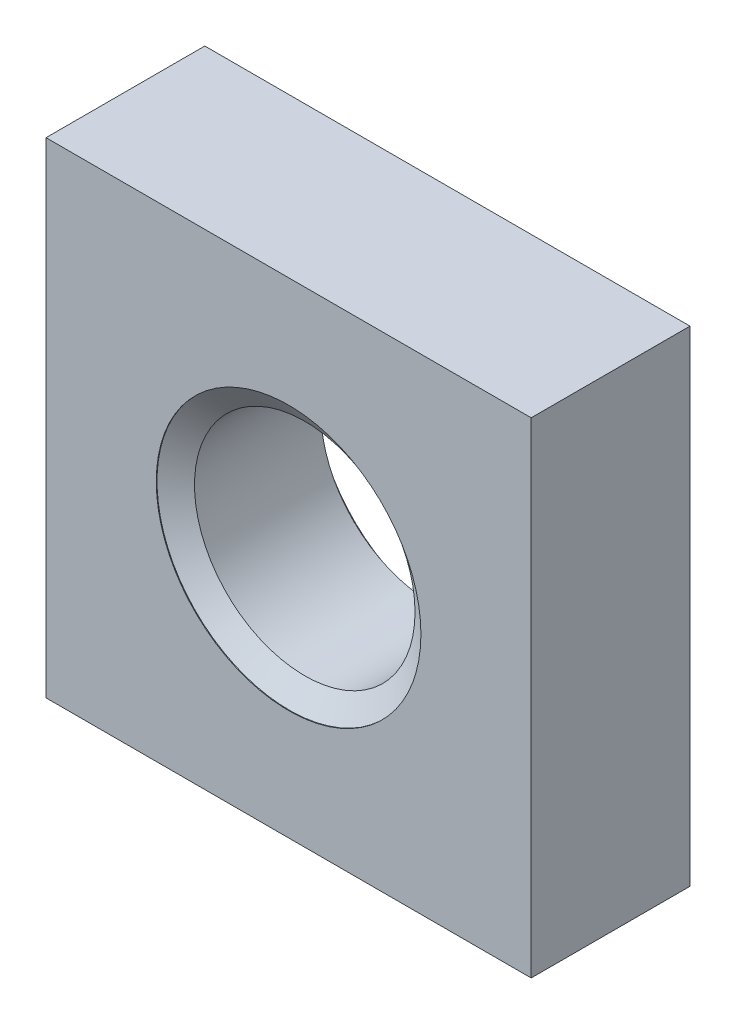
ISO-10303-21;
HEADER;
FILE_DESCRIPTION(('STEP AP214'),'2;1');
FILE_NAME('part.step','',(''),(''),'','','');
FILE_SCHEMA(('AUTOMOTIVE_DESIGN { 1 0 10303 214 1 1 1 1 }'));
ENDSEC;
DATA;
#1=APPLICATION_CONTEXT('core data for automotive mechanical design processes');
#2=APPLICATION_PROTOCOL_DEFINITION('international standard','automotive_design',2000,#1);
#3=PRODUCT_CONTEXT('',#1,'mechanical');
#4=PRODUCT('Part','Part','',(#3));
#5=PRODUCT_RELATED_PRODUCT_CATEGORY('part','',(#4));
#6=PRODUCT_DEFINITION_FORMATION('','',#4);
#7=PRODUCT_DEFINITION_CONTEXT('part definition',#1,'design');
#8=PRODUCT_DEFINITION('design','',#6,#7);
#9=PRODUCT_DEFINITION_SHAPE('','',#8);
#10=(LENGTH_UNIT() NAMED_UNIT(*) SI_UNIT(.MILLI.,.METRE.));
#11=(NAMED_UNIT(*) PLANE_ANGLE_UNIT() SI_UNIT($,.RADIAN.));
#12=(NAMED_UNIT(*) SI_UNIT($,.STERADIAN.) SOLID_ANGLE_UNIT());
#13=UNCERTAINTY_MEASURE_WITH_UNIT(LENGTH_MEASURE(1.E-05),#10,'distance_accuracy_value','');
#14=(GEOMETRIC_REPRESENTATION_CONTEXT(3) GLOBAL_UNCERTAINTY_ASSIGNED_CONTEXT((#13)) GLOBAL_UNIT_ASSIGNED_CONTEXT((#10,
#11,#12)) REPRESENTATION_CONTEXT('',''));
#15=CARTESIAN_POINT('',(0.,0.,0.));
#16=DIRECTION('',(0.,0.,1.));
#17=DIRECTION('',(1.,0.,0.));
#18=AXIS2_PLACEMENT_3D('',#15,#16,#17);
#19=CARTESIAN_POINT('',(0.,0.,-1.8));
#20=DIRECTION('',(0.,0.,1.));
#21=DIRECTION('',(1.,0.,0.));
#22=AXIS2_PLACEMENT_3D('',#19,#20,#21);
#23=CYLINDRICAL_SURFACE('',#22,1.25);
#24=CARTESIAN_POINT('',(0.,0.,-0.183051884552427));
#25=DIRECTION('',(0.,0.,1.));
#26=DIRECTION('',(1.,0.,0.));
#27=AXIS2_PLACEMENT_3D('',#24,#25,#26);
#28=CIRCLE('',#27,1.25);
#29=CARTESIAN_POINT('',(1.25,0.,-0.183051884552427));
#30=VERTEX_POINT('',#29);
#31=EDGE_CURVE('E114',#30,#30,#28,.F.);
#32=ORIENTED_EDGE('',*,*,#31,.F.);
#33=EDGE_LOOP('',(#32));
#34=FACE_BOUND('',#33,.T.);
#35=CARTESIAN_POINT('',(0.,0.,-1.61594811544757));
#36=DIRECTION('',(0.,0.,-1.));
#37=DIRECTION('',(-1.,0.,0.));
#38=AXIS2_PLACEMENT_3D('',#35,#36,#37);
#39=CIRCLE('',#38,1.25);
#40=CARTESIAN_POINT('',(-1.25,0.,-1.61594811544757));
#41=VERTEX_POINT('',#40);
#42=EDGE_CURVE('E39',#41,#41,#39,.F.);
#43=ORIENTED_EDGE('',*,*,#42,.F.);
#44=EDGE_LOOP('',(#43));
#45=FACE_BOUND('',#44,.T.);
#46=ADVANCED_FACE('F35',(#34,#45),#23,.F.);
#47=CARTESIAN_POINT('',(-2.75,-2.75,-1.8));
#48=DIRECTION('',(-1.,0.,0.));
#49=DIRECTION('',(0.,0.,1.));
#50=AXIS2_PLACEMENT_3D('',#47,#48,#49);
#51=PLANE('',#50);
#52=DIRECTION('',(0.,-1.,0.));
#53=VECTOR('',#52,1.);
#54=CARTESIAN_POINT('',(-2.75,-2.75,0.));
#55=LINE('',#54,#53);
#56=CARTESIAN_POINT('',(-2.75,2.75,0.));
#57=VERTEX_POINT('',#56);
#58=CARTESIAN_POINT('',(-2.75,-2.75,0.));
#59=VERTEX_POINT('',#58);
#60=EDGE_CURVE('E103',#57,#59,#55,.T.);
#61=ORIENTED_EDGE('',*,*,#60,.F.);
#62=DIRECTION('',(0.,0.,1.));
#63=VECTOR('',#62,1.);
#64=CARTESIAN_POINT('',(-2.75,2.75,-1.8));
#65=LINE('',#64,#63);
#66=CARTESIAN_POINT('',(-2.75,2.75,-1.8));
#67=VERTEX_POINT('',#66);
#68=EDGE_CURVE('E11',#67,#57,#65,.T.);
#69=ORIENTED_EDGE('',*,*,#68,.F.);
#70=DIRECTION('',(0.,-1.,0.));
#71=VECTOR('',#70,1.);
#72=CARTESIAN_POINT('',(-2.75,-2.75,-1.8));
#73=LINE('',#72,#71);
#74=CARTESIAN_POINT('',(-2.75,-2.75,-1.8));
#75=VERTEX_POINT('',#74);
#76=EDGE_CURVE('E96',#67,#75,#73,.T.);
#77=ORIENTED_EDGE('',*,*,#76,.T.);
#78=DIRECTION('',(0.,0.,1.));
#79=VECTOR('',#78,1.);
#80=CARTESIAN_POINT('',(-2.75,-2.75,-1.8));
#81=LINE('',#80,#79);
#82=EDGE_CURVE('E79',#75,#59,#81,.T.);
#83=ORIENTED_EDGE('',*,*,#82,.T.);
#84=EDGE_LOOP('',(#61,#69,#77,#83));
#85=FACE_BOUND('',#84,.T.);
#86=ADVANCED_FACE('F37',(#85),#51,.T.);
#87=CARTESIAN_POINT('',(-2.75,2.75,-1.8));
#88=DIRECTION('',(0.,1.,0.));
#89=DIRECTION('',(-1.,0.,0.));
#90=AXIS2_PLACEMENT_3D('',#87,#88,#89);
#91=PLANE('',#90);
#92=DIRECTION('',(-1.,0.,0.));
#93=VECTOR('',#92,1.);
#94=CARTESIAN_POINT('',(-2.75,2.75,0.));
#95=LINE('',#94,#93);
#96=CARTESIAN_POINT('',(2.75,2.75,0.));
#97=VERTEX_POINT('',#96);
#98=EDGE_CURVE('E98',#97,#57,#95,.T.);
#99=ORIENTED_EDGE('',*,*,#98,.F.);
#100=DIRECTION('',(0.,0.,1.));
#101=VECTOR('',#100,1.);
#102=CARTESIAN_POINT('',(2.75,2.75,-1.8));
#103=LINE('',#102,#101);
#104=CARTESIAN_POINT('',(2.75,2.75,-1.8));
#105=VERTEX_POINT('',#104);
#106=EDGE_CURVE('E45',#105,#97,#103,.T.);
#107=ORIENTED_EDGE('',*,*,#106,.F.);
#108=DIRECTION('',(-1.,0.,0.));
#109=VECTOR('',#108,1.);
#110=CARTESIAN_POINT('',(-2.75,2.75,-1.8));
#111=LINE('',#110,#109);
#112=EDGE_CURVE('E93',#105,#67,#111,.T.);
#113=ORIENTED_EDGE('',*,*,#112,.T.);
#114=ORIENTED_EDGE('',*,*,#68,.T.);
#115=EDGE_LOOP('',(#99,#107,#113,#114));
#116=FACE_BOUND('',#115,.T.);
#117=ADVANCED_FACE('F145',(#116),#91,.T.);
#118=CARTESIAN_POINT('',(2.75,-2.75,-1.8));
#119=DIRECTION('',(1.,0.,0.));
#120=DIRECTION('',(0.,1.,0.));
#121=AXIS2_PLACEMENT_3D('',#118,#119,#120);
#122=PLANE('',#121);
#123=DIRECTION('',(0.,1.,0.));
#124=VECTOR('',#123,1.);
#125=CARTESIAN_POINT('',(2.75,-2.75,0.));
#126=LINE('',#125,#124);
#127=CARTESIAN_POINT('',(2.75,-2.75,0.));
#128=VERTEX_POINT('',#127);
#129=EDGE_CURVE('E87',#128,#97,#126,.T.);
#130=ORIENTED_EDGE('',*,*,#129,.F.);
#131=DIRECTION('',(0.,0.,1.));
#132=VECTOR('',#131,1.);
#133=CARTESIAN_POINT('',(2.75,-2.75,-1.8));
#134=LINE('',#133,#132);
#135=CARTESIAN_POINT('',(2.75,-2.75,-1.8));
#136=VERTEX_POINT('',#135);
#137=EDGE_CURVE('E82',#136,#128,#134,.T.);
#138=ORIENTED_EDGE('',*,*,#137,.F.);
#139=DIRECTION('',(0.,1.,0.));
#140=VECTOR('',#139,1.);
#141=CARTESIAN_POINT('',(2.75,-2.75,-1.8));
#142=LINE('',#141,#140);
#143=EDGE_CURVE('E85',#136,#105,#142,.T.);
#144=ORIENTED_EDGE('',*,*,#143,.T.);
#145=ORIENTED_EDGE('',*,*,#106,.T.);
#146=EDGE_LOOP('',(#130,#138,#144,#145));
#147=FACE_BOUND('',#146,.T.);
#148=ADVANCED_FACE('F84',(#147),#122,.T.);
#149=CARTESIAN_POINT('',(-2.75,-2.75,-1.8));
#150=DIRECTION('',(0.,-1.,0.));
#151=DIRECTION('',(0.,0.,-1.));
#152=AXIS2_PLACEMENT_3D('',#149,#150,#151);
#153=PLANE('',#152);
#154=DIRECTION('',(1.,0.,0.));
#155=VECTOR('',#154,1.);
#156=CARTESIAN_POINT('',(-2.75,-2.75,0.));
#157=LINE('',#156,#155);
#158=EDGE_CURVE('E106',#59,#128,#157,.T.);
#159=ORIENTED_EDGE('',*,*,#158,.F.);
#160=ORIENTED_EDGE('',*,*,#82,.F.);
#161=DIRECTION('',(1.,0.,0.));
#162=VECTOR('',#161,1.);
#163=CARTESIAN_POINT('',(-2.75,-2.75,-1.8));
#164=LINE('',#163,#162);
#165=EDGE_CURVE('E92',#75,#136,#164,.T.);
#166=ORIENTED_EDGE('',*,*,#165,.T.);
#167=ORIENTED_EDGE('',*,*,#137,.T.);
#168=EDGE_LOOP('',(#159,#160,#166,#167));
#169=FACE_BOUND('',#168,.T.);
#170=ADVANCED_FACE('F95',(#169),#153,.T.);
#171=CARTESIAN_POINT('',(-2.75,-2.75,-1.8));
#172=DIRECTION('',(0.,0.,-1.));
#173=DIRECTION('',(-1.,0.,0.));
#174=AXIS2_PLACEMENT_3D('',#171,#172,#173);
#175=PLANE('',#174);
#176=CARTESIAN_POINT('',(0.,0.,-1.8));
#177=DIRECTION('',(0.,0.,-1.));
#178=DIRECTION('',(-1.,0.,0.));
#179=AXIS2_PLACEMENT_3D('',#176,#177,#178);
#180=CIRCLE('',#179,1.5);
#181=CARTESIAN_POINT('',(-1.5,0.,-1.8));
#182=VERTEX_POINT('',#181);
#183=EDGE_CURVE('E119',#182,#182,#180,.F.);
#184=ORIENTED_EDGE('',*,*,#183,.T.);
#185=EDGE_LOOP('',(#184));
#186=FACE_BOUND('',#185,.T.);
#187=ORIENTED_EDGE('',*,*,#76,.F.);
#188=ORIENTED_EDGE('',*,*,#112,.F.);
#189=ORIENTED_EDGE('',*,*,#143,.F.);
#190=ORIENTED_EDGE('',*,*,#165,.F.);
#191=EDGE_LOOP('',(#187,#188,#189,#190));
#192=FACE_BOUND('',#191,.T.);
#193=ADVANCED_FACE('F91',(#186,#192),#175,.T.);
#194=CARTESIAN_POINT('',(-2.75,-2.75,0.));
#195=DIRECTION('',(0.,0.,-1.));
#196=DIRECTION('',(-1.,0.,0.));
#197=AXIS2_PLACEMENT_3D('',#194,#195,#196);
#198=PLANE('',#197);
#199=CARTESIAN_POINT('',(0.,0.,0.));
#200=DIRECTION('',(0.,0.,-1.));
#201=DIRECTION('',(-1.,0.,0.));
#202=AXIS2_PLACEMENT_3D('',#199,#200,#201);
#203=CIRCLE('',#202,1.5);
#204=CARTESIAN_POINT('',(-1.5,0.,0.));
#205=VERTEX_POINT('',#204);
#206=EDGE_CURVE('E107',#205,#205,#203,.F.);
#207=ORIENTED_EDGE('',*,*,#206,.F.);
#208=EDGE_LOOP('',(#207));
#209=FACE_BOUND('',#208,.T.);
#210=ORIENTED_EDGE('',*,*,#60,.T.);
#211=ORIENTED_EDGE('',*,*,#158,.T.);
#212=ORIENTED_EDGE('',*,*,#129,.T.);
#213=ORIENTED_EDGE('',*,*,#98,.T.);
#214=EDGE_LOOP('',(#210,#211,#212,#213));
#215=FACE_BOUND('',#214,.T.);
#216=ADVANCED_FACE('F138',(#209,#215),#198,.F.);
#217=CARTESIAN_POINT('',(0.,0.,-25.0375057290932));
#218=DIRECTION('',(0.,0.,1.));
#219=DIRECTION('',(1.,0.,0.));
#220=AXIS2_PLACEMENT_3D('',#217,#218,#219);
#221=CYLINDRICAL_SURFACE('',#220,1.5);
#222=CARTESIAN_POINT('',(0.,0.,-0.00800000000000106));
#223=DIRECTION('',(0.,0.,1.));
#224=DIRECTION('',(1.,0.,0.));
#225=AXIS2_PLACEMENT_3D('',#222,#223,#224);
#226=CIRCLE('',#225,1.5);
#227=CARTESIAN_POINT('',(1.5,0.,-0.00800000000000106));
#228=VERTEX_POINT('',#227);
#229=EDGE_CURVE('E117',#228,#228,#226,.T.);
#230=ORIENTED_EDGE('',*,*,#229,.F.);
#231=EDGE_LOOP('',(#230));
#232=FACE_BOUND('',#231,.T.);
#233=ORIENTED_EDGE('',*,*,#206,.T.);
#234=EDGE_LOOP('',(#233));
#235=FACE_BOUND('',#234,.T.);
#236=ADVANCED_FACE('F135',(#232,#235),#221,.F.);
#237=CARTESIAN_POINT('',(0.,0.,-0.20055707300767));
#238=DIRECTION('',(0.,0.,1.));
#239=DIRECTION('',(1.,0.,0.));
#240=AXIS2_PLACEMENT_3D('',#237,#238,#239);
#241=CONICAL_SURFACE('',#240,1.225,0.959931088596884);
#242=ORIENTED_EDGE('',*,*,#229,.T.);
#243=EDGE_LOOP('',(#242));
#244=FACE_BOUND('',#243,.T.);
#245=ORIENTED_EDGE('',*,*,#31,.T.);
#246=EDGE_LOOP('',(#245));
#247=FACE_BOUND('',#246,.T.);
#248=ADVANCED_FACE('F132',(#244,#247),#241,.F.);
#249=CARTESIAN_POINT('',(0.,0.,-1.791));
#250=DIRECTION('',(0.,0.,-1.));
#251=DIRECTION('',(-1.,0.,0.));
#252=AXIS2_PLACEMENT_3D('',#249,#250,#251);
#253=CONICAL_SURFACE('',#252,1.5,0.959931088596876);
#254=CARTESIAN_POINT('',(0.,0.,-1.791));
#255=DIRECTION('',(0.,0.,1.));
#256=DIRECTION('',(1.,0.,0.));
#257=AXIS2_PLACEMENT_3D('',#254,#255,#256);
#258=CIRCLE('',#257,1.5);
#259=CARTESIAN_POINT('',(1.5,0.,-1.791));
#260=VERTEX_POINT('',#259);
#261=EDGE_CURVE('E121',#260,#260,#258,.T.);
#262=ORIENTED_EDGE('',*,*,#261,.F.);
#263=EDGE_LOOP('',(#262));
#264=FACE_BOUND('',#263,.T.);
#265=ORIENTED_EDGE('',*,*,#42,.T.);
#266=EDGE_LOOP('',(#265));
#267=FACE_BOUND('',#266,.T.);
#268=ADVANCED_FACE('F213',(#264,#267),#253,.F.);
#269=CARTESIAN_POINT('',(0.,0.,-25.0375057290932));
#270=DIRECTION('',(0.,0.,1.));
#271=DIRECTION('',(1.,0.,0.));
#272=AXIS2_PLACEMENT_3D('',#269,#270,#271);
#273=CYLINDRICAL_SURFACE('',#272,1.5);
#274=ORIENTED_EDGE('',*,*,#183,.F.);
#275=EDGE_LOOP('',(#274));
#276=FACE_BOUND('',#275,.T.);
#277=ORIENTED_EDGE('',*,*,#261,.T.);
#278=EDGE_LOOP('',(#277));
#279=FACE_BOUND('',#278,.T.);
#280=ADVANCED_FACE('F220',(#276,#279),#273,.F.);
#281=CLOSED_SHELL('',(#46,#86,#117,#148,#170,#193,#216,#236,#248,#268,#280));
#282=MANIFOLD_SOLID_BREP('B2',#281);
#283=ADVANCED_BREP_SHAPE_REPRESENTATION('',(#18,#282),#14);
#284=SHAPE_DEFINITION_REPRESENTATION(#9,#283);
ENDSEC;
END-ISO-10303-21;
